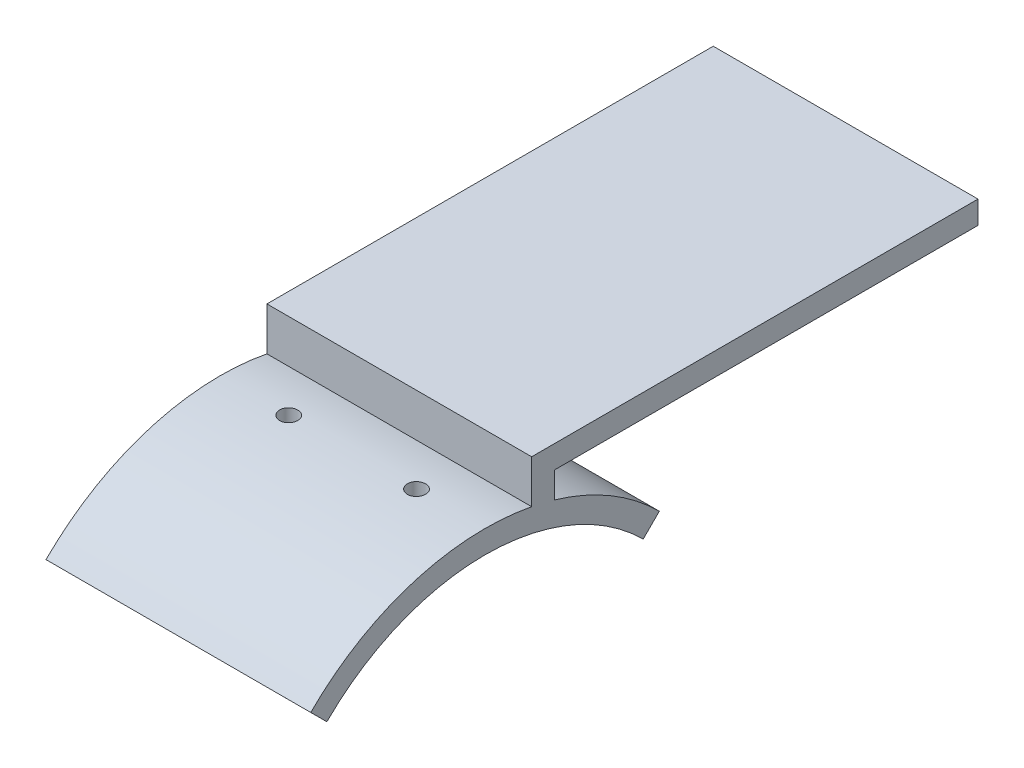
ISO-10303-21;
HEADER;
FILE_DESCRIPTION(('STEP AP214'),'2;1');
FILE_NAME('part.step','',(''),(''),'','','');
FILE_SCHEMA(('AUTOMOTIVE_DESIGN { 1 0 10303 214 1 1 1 1 }'));
ENDSEC;
DATA;
#1=APPLICATION_CONTEXT('core data for automotive mechanical design processes');
#2=APPLICATION_PROTOCOL_DEFINITION('international standard','automotive_design',2000,#1);
#3=PRODUCT_CONTEXT('',#1,'mechanical');
#4=PRODUCT('Part','Part','',(#3));
#5=PRODUCT_RELATED_PRODUCT_CATEGORY('part','',(#4));
#6=PRODUCT_DEFINITION_FORMATION('','',#4);
#7=PRODUCT_DEFINITION_CONTEXT('part definition',#1,'design');
#8=PRODUCT_DEFINITION('design','',#6,#7);
#9=PRODUCT_DEFINITION_SHAPE('','',#8);
#10=(LENGTH_UNIT() NAMED_UNIT(*) SI_UNIT(.MILLI.,.METRE.));
#11=(NAMED_UNIT(*) PLANE_ANGLE_UNIT() SI_UNIT($,.RADIAN.));
#12=(NAMED_UNIT(*) SI_UNIT($,.STERADIAN.) SOLID_ANGLE_UNIT());
#13=UNCERTAINTY_MEASURE_WITH_UNIT(LENGTH_MEASURE(1.E-05),#10,'distance_accuracy_value','');
#14=(GEOMETRIC_REPRESENTATION_CONTEXT(3) GLOBAL_UNCERTAINTY_ASSIGNED_CONTEXT((#13)) GLOBAL_UNIT_ASSIGNED_CONTEXT((#10,
#11,#12)) REPRESENTATION_CONTEXT('',''));
#15=CARTESIAN_POINT('',(0.,0.,0.));
#16=DIRECTION('',(0.,0.,1.));
#17=DIRECTION('',(1.,0.,0.));
#18=AXIS2_PLACEMENT_3D('',#15,#16,#17);
#19=CARTESIAN_POINT('',(58.,-49.,0.));
#20=DIRECTION('',(-1.,0.,0.));
#21=DIRECTION('',(0.,0.,1.));
#22=AXIS2_PLACEMENT_3D('',#19,#20,#21);
#23=CYLINDRICAL_SURFACE('',#22,54.);
#24=CARTESIAN_POINT('',(15.,4.96295025292816,-2.));
#25=CARTESIAN_POINT('',(14.8877004654641,4.96295075219625,-1.99999503270246));
#26=CARTESIAN_POINT('',(14.7753204837801,4.96330457041074,-1.99050985696399));
#27=CARTESIAN_POINT('',(14.5536583599373,4.96468192720475,-1.95280482207605));
#28=CARTESIAN_POINT('',(14.4443800648061,4.9657062625401,-1.92456267398281));
#29=CARTESIAN_POINT('',(14.2321645376487,4.96830846029025,-1.8501513309941));
#30=CARTESIAN_POINT('',(14.1292241942832,4.96988604852142,-1.80399101485833));
#31=CARTESIAN_POINT('',(13.9325819624977,4.97341664035689,-1.69506666197583));
#32=CARTESIAN_POINT('',(13.8388778483638,4.97536955318052,-1.63230663886105));
#33=CARTESIAN_POINT('',(13.6632813240093,4.97943214078296,-1.49191985783884));
#34=CARTESIAN_POINT('',(13.5813952386077,4.98154189859433,-1.41428519060976));
#35=CARTESIAN_POINT('',(13.4318127655717,4.98567963848786,-1.24636765667044));
#36=CARTESIAN_POINT('',(13.364116947148,4.98770761728701,-1.15608428282794));
#37=CARTESIAN_POINT('',(13.2448231574326,4.9914537389983,-0.965404059472298));
#38=CARTESIAN_POINT('',(13.1932295202032,4.99317179844014,-0.865004496689));
#39=CARTESIAN_POINT('',(13.1076326423792,4.99610369103976,-0.65696109417916));
#40=CARTESIAN_POINT('',(13.0736293128277,4.99731752674748,-0.549317291091011));
#41=CARTESIAN_POINT('',(13.024193360982,4.99910365419231,-0.329893785775234));
#42=CARTESIAN_POINT('',(13.0087521506924,4.99967624260208,-0.218116020869811));
#43=CARTESIAN_POINT('',(12.9968522783798,5.00011633116689,0.00644641286406914));
#44=CARTESIAN_POINT('',(13.0003935188961,4.99998383494201,0.11923107651989));
#45=CARTESIAN_POINT('',(13.0263508322198,4.99902894039687,0.342547605934101));
#46=CARTESIAN_POINT('',(13.0487576474903,4.99820688045356,0.453080549393811));
#47=CARTESIAN_POINT('',(13.1117957299707,4.99596588071386,0.668815003977497));
#48=CARTESIAN_POINT('',(13.1524270480244,4.99454693925226,0.77401650022657));
#49=CARTESIAN_POINT('',(13.2507713654548,4.99127148918127,0.976131592935503));
#50=CARTESIAN_POINT('',(13.3084886002621,4.98941487209969,1.07304312670836));
#51=CARTESIAN_POINT('',(13.4393632471326,4.98547326219279,1.25580474155332));
#52=CARTESIAN_POINT('',(13.5125207162394,4.98338826852377,1.34165478175718));
#53=CARTESIAN_POINT('',(13.6722515385268,4.97922334898793,1.49991041139662));
#54=CARTESIAN_POINT('',(13.7588329230215,4.977143426917,1.57230789500168));
#55=CARTESIAN_POINT('',(13.9429255568458,4.9732244006064,1.70154089734328));
#56=CARTESIAN_POINT('',(14.0404368082413,4.97138529641223,1.75837641313842));
#57=CARTESIAN_POINT('',(14.2436258474276,4.96815537784695,1.85487129914634));
#58=CARTESIAN_POINT('',(14.3493037660529,4.96676457065964,1.8945303941165));
#59=CARTESIAN_POINT('',(14.5658242206931,4.96458836861988,1.95554138636488));
#60=CARTESIAN_POINT('',(14.6766667353422,4.96380297126312,1.97689335937194));
#61=CARTESIAN_POINT('',(14.9002994172924,4.96292660777983,2.00067403394862));
#62=CARTESIAN_POINT('',(15.0130883882178,4.96283522931798,2.00311397168588));
#63=CARTESIAN_POINT('',(15.2374742888175,4.96335613160644,1.98903060797015));
#64=CARTESIAN_POINT('',(15.3490712206265,4.96396841109642,1.97250734048281));
#65=CARTESIAN_POINT('',(15.5678737983002,4.96582723482666,1.92097591146345));
#66=CARTESIAN_POINT('',(15.6750806509444,4.96707360348164,1.88597286705572));
#67=CARTESIAN_POINT('',(15.8820969497555,4.97005996090548,1.79848067721363));
#68=CARTESIAN_POINT('',(15.981906372771,4.97179995121912,1.74599147705664));
#69=CARTESIAN_POINT('',(16.1713463258866,4.97557841976828,1.62498802726334));
#70=CARTESIAN_POINT('',(16.2609720229563,4.97761703868614,1.55646621561187));
#71=CARTESIAN_POINT('',(16.4274518114463,4.98176246454917,1.40535371250946));
#72=CARTESIAN_POINT('',(16.5043058558399,4.98386927174539,1.32276296925734));
#73=CARTESIAN_POINT('',(16.6430983122484,4.98791478771046,1.1458088862065));
#74=CARTESIAN_POINT('',(16.705029475557,4.98985341449521,1.05143985881963));
#75=CARTESIAN_POINT('',(16.8121686240526,4.99334288231886,0.853636918662812));
#76=CARTESIAN_POINT('',(16.8573766573251,4.99489372447279,0.750203031958873));
#77=CARTESIAN_POINT('',(16.9297735445759,4.99743242260358,0.537233704007306));
#78=CARTESIAN_POINT('',(16.9569670768412,4.99842042473819,0.427699854909739));
#79=CARTESIAN_POINT('',(16.9925783710272,4.99972265765609,0.205617407781122));
#80=CARTESIAN_POINT('',(17.0009961757582,5.00003688997563,0.0930688166245369));
#81=CARTESIAN_POINT('',(16.9988165393224,4.99995617370588,-0.131776034819963));
#82=CARTESIAN_POINT('',(16.988230498112,4.99956165028225,-0.244072405950878));
#83=CARTESIAN_POINT('',(16.9483671608327,4.99810870018859,-0.465292712722726));
#84=CARTESIAN_POINT('',(16.9190898281955,4.99705027221968,-0.574216641765232));
#85=CARTESIAN_POINT('',(16.8426769294049,4.99438869003729,-0.785603515983294));
#86=CARTESIAN_POINT('',(16.7955411002166,4.99278552780054,-0.888066365968755));
#87=CARTESIAN_POINT('',(16.6847521100114,4.98921501319258,-1.08362305451929));
#88=CARTESIAN_POINT('',(16.621099519618,4.98724767340369,-1.17671721660103));
#89=CARTESIAN_POINT('',(16.4790463961729,4.98316913005195,-1.35094876301514));
#90=CARTESIAN_POINT('',(16.4006386112852,4.98105785607556,-1.432080232843));
#91=CARTESIAN_POINT('',(16.2312925741472,4.97692962875348,-1.58005160937692));
#92=CARTESIAN_POINT('',(16.140351229889,4.97491269884728,-1.64688797909108));
#93=CARTESIAN_POINT('',(15.9484734639744,4.97119973048303,-1.76438911512227));
#94=CARTESIAN_POINT('',(15.8475297027455,4.96950393035969,-1.81504188937958));
#95=CARTESIAN_POINT('',(15.6386416867103,4.96662859907737,-1.89862134948373));
#96=CARTESIAN_POINT('',(15.530705928725,4.96544845431244,-1.93156911426498));
#97=CARTESIAN_POINT('',(15.3517430096865,4.96405209880561,-1.97009805778151));
#98=CARTESIAN_POINT('',(15.2818767720653,4.96364070970133,-1.98129711610505));
#99=CARTESIAN_POINT('',(15.1413509819868,4.96308962968237,-1.99624964895));
#100=CARTESIAN_POINT('',(15.0706914298909,4.96294993864391,-2.00000312686394));
#101=CARTESIAN_POINT('',(15.,4.96295025292816,-2.));
#102=B_SPLINE_CURVE_WITH_KNOTS('',3,(#24,#25,#26,#27,#28,#29,#30,#31,#32,#33,#34,#35,#36,#37,
#38,#39,#40,#41,#42,#43,#44,#45,#46,#47,#48,#49,#50,#51,#52,#53,#54,#55,#56,#57,#58,#59,#60,#61,
#62,#63,#64,#65,#66,#67,#68,#69,#70,#71,#72,#73,#74,#75,#76,#77,#78,#79,#80,#81,#82,#83,#84,#85,
#86,#87,#88,#89,#90,#91,#92,#93,#94,#95,#96,#97,#98,#99,#100,#101),.UNSPECIFIED.,.T.,.F.,(4,2,2,
2,2,2,2,2,2,2,2,2,2,2,2,2,2,2,2,2,2,2,2,2,2,2,2,2,2,2,2,2,2,2,2,2,2,2,4),(0.,0.33664056542318,
0.673681878887206,1.0105563953544,1.34734953350205,1.68432225479064,2.02130849039912,
2.35838535113826,2.69546050720917,3.03237965116837,3.36929706530259,3.70604924679232,
4.04280236777934,4.37963903655089,4.71647694977707,5.053517170975,5.39055745587788,
5.72760314146463,6.06464743282898,6.40149146141841,6.73833488667564,7.07508508752152,
7.41183634223107,7.7487467519132,8.08565840211133,8.42273337684121,8.75980738234381,
9.09679381685139,9.43377948299982,9.77056306698981,10.1073473098796,10.4441365134018,
10.7809140830289,11.1178576053597,11.4548844003745,11.7921603564599,12.1290338694834,
12.3409458232649,12.5528576804904),.UNSPECIFIED.);
#103=CARTESIAN_POINT('',(15.,4.96295025292816,-2.));
#104=VERTEX_POINT('',#103);
#105=EDGE_CURVE('E152',#104,#104,#102,.T.);
#106=ORIENTED_EDGE('',*,*,#105,.F.);
#107=EDGE_LOOP('',(#106));
#108=FACE_BOUND('',#107,.T.);
#109=CARTESIAN_POINT('',(0.,-49.,0.));
#110=DIRECTION('',(1.,0.,0.));
#111=DIRECTION('',(0.,0.,1.));
#112=AXIS2_PLACEMENT_3D('',#109,#110,#111);
#113=CIRCLE('',#112,54.);
#114=CARTESIAN_POINT('',(0.,4.02446662482584,-10.2179224479701));
#115=VERTEX_POINT('',#114);
#116=CARTESIAN_POINT('',(0.,-10.8162338159265,38.1837661840736));
#117=VERTEX_POINT('',#116);
#118=EDGE_CURVE('E158',#115,#117,#113,.T.);
#119=ORIENTED_EDGE('',*,*,#118,.T.);
#120=DIRECTION('',(-1.,0.,0.));
#121=VECTOR('',#120,1.);
#122=CARTESIAN_POINT('',(58.,-10.8162338159265,38.1837661840736));
#123=LINE('',#122,#121);
#124=CARTESIAN_POINT('',(58.,-10.8162338159265,38.1837661840736));
#125=VERTEX_POINT('',#124);
#126=EDGE_CURVE('E174',#125,#117,#123,.T.);
#127=ORIENTED_EDGE('',*,*,#126,.F.);
#128=CARTESIAN_POINT('',(58.,-49.,0.));
#129=DIRECTION('',(1.,0.,0.));
#130=DIRECTION('',(0.,0.,1.));
#131=AXIS2_PLACEMENT_3D('',#128,#129,#130);
#132=CIRCLE('',#131,54.);
#133=CARTESIAN_POINT('',(58.,4.02446662482584,-10.2179224479701));
#134=VERTEX_POINT('',#133);
#135=EDGE_CURVE('E249',#134,#125,#132,.T.);
#136=ORIENTED_EDGE('',*,*,#135,.F.);
#137=DIRECTION('',(-1.,0.,0.));
#138=VECTOR('',#137,1.);
#139=CARTESIAN_POINT('',(58.,4.02446662482584,-10.2179224479701));
#140=LINE('',#139,#138);
#141=EDGE_CURVE('E177',#134,#115,#140,.T.);
#142=ORIENTED_EDGE('',*,*,#141,.T.);
#143=EDGE_LOOP('',(#119,#127,#136,#142));
#144=FACE_BOUND('',#143,.T.);
#145=CARTESIAN_POINT('',(43.,4.96295025292816,-2.));
#146=CARTESIAN_POINT('',(42.8877004654641,4.96295075219625,-1.99999503270246));
#147=CARTESIAN_POINT('',(42.7753204837801,4.96330457041074,-1.99050985696398));
#148=CARTESIAN_POINT('',(42.5536583599373,4.96468192720475,-1.95280482207605));
#149=CARTESIAN_POINT('',(42.4443800648061,4.9657062625401,-1.92456267398281));
#150=CARTESIAN_POINT('',(42.2321645376487,4.96830846029025,-1.8501513309941));
#151=CARTESIAN_POINT('',(42.1292241942832,4.96988604852143,-1.80399101485833));
#152=CARTESIAN_POINT('',(41.9325819624977,4.97341664035689,-1.69506666197583));
#153=CARTESIAN_POINT('',(41.8388778483638,4.97536955318052,-1.63230663886105));
#154=CARTESIAN_POINT('',(41.6632813240093,4.97943214078296,-1.49191985783884));
#155=CARTESIAN_POINT('',(41.5813952386077,4.98154189859433,-1.41428519060976));
#156=CARTESIAN_POINT('',(41.4318127655717,4.98567963848786,-1.24636765667044));
#157=CARTESIAN_POINT('',(41.364116947148,4.98770761728701,-1.15608428282794));
#158=CARTESIAN_POINT('',(41.2448231574326,4.9914537389983,-0.965404059472301));
#159=CARTESIAN_POINT('',(41.1932295202032,4.99317179844013,-0.865004496689002));
#160=CARTESIAN_POINT('',(41.1076326423792,4.99610369103976,-0.656961094179162));
#161=CARTESIAN_POINT('',(41.0736293128277,4.99731752674748,-0.549317291091013));
#162=CARTESIAN_POINT('',(41.024193360982,4.99910365419231,-0.329893785775239));
#163=CARTESIAN_POINT('',(41.0087521506924,4.99967624260207,-0.218116020869816));
#164=CARTESIAN_POINT('',(40.9968522783798,5.00011633116688,0.00644641286406233));
#165=CARTESIAN_POINT('',(41.0003935188961,4.999983834942,0.119231076519882));
#166=CARTESIAN_POINT('',(41.0263508322198,4.99902894039688,0.342547605934094));
#167=CARTESIAN_POINT('',(41.0487576474903,4.99820688045357,0.453080549393804));
#168=CARTESIAN_POINT('',(41.1117957299707,4.99596588071387,0.66881500397749));
#169=CARTESIAN_POINT('',(41.1524270480244,4.99454693925226,0.774016500226562));
#170=CARTESIAN_POINT('',(41.2507713654549,4.99127148918127,0.976131592935494));
#171=CARTESIAN_POINT('',(41.3084886002621,4.98941487209968,1.07304312670835));
#172=CARTESIAN_POINT('',(41.4393632471326,4.98547326219279,1.25580474155331));
#173=CARTESIAN_POINT('',(41.5125207162394,4.98338826852376,1.34165478175717));
#174=CARTESIAN_POINT('',(41.6722515385268,4.97922334898792,1.49991041139662));
#175=CARTESIAN_POINT('',(41.7588329230215,4.977143426917,1.57230789500167));
#176=CARTESIAN_POINT('',(41.9429255568458,4.9732244006064,1.70154089734327));
#177=CARTESIAN_POINT('',(42.0404368082413,4.97138529641223,1.75837641313841));
#178=CARTESIAN_POINT('',(42.2436258474276,4.96815537784695,1.85487129914633));
#179=CARTESIAN_POINT('',(42.3493037660529,4.96676457065964,1.89453039411649));
#180=CARTESIAN_POINT('',(42.565824220693,4.96458836861989,1.95554138636488));
#181=CARTESIAN_POINT('',(42.6766667353422,4.96380297126312,1.97689335937193));
#182=CARTESIAN_POINT('',(42.9002994172924,4.96292660777983,2.00067403394861));
#183=CARTESIAN_POINT('',(43.0130883882178,4.96283522931797,2.00311397168588));
#184=CARTESIAN_POINT('',(43.2374742888175,4.96335613160644,1.98903060797014));
#185=CARTESIAN_POINT('',(43.3490712206265,4.96396841109642,1.97250734048281));
#186=CARTESIAN_POINT('',(43.5678737983002,4.96582723482667,1.92097591146344));
#187=CARTESIAN_POINT('',(43.6750806509444,4.96707360348164,1.88597286705572));
#188=CARTESIAN_POINT('',(43.8820969497555,4.97005996090547,1.79848067721363));
#189=CARTESIAN_POINT('',(43.981906372771,4.97179995121911,1.74599147705664));
#190=CARTESIAN_POINT('',(44.1713463258866,4.97557841976827,1.62498802726334));
#191=CARTESIAN_POINT('',(44.2609720229563,4.97761703868613,1.55646621561188));
#192=CARTESIAN_POINT('',(44.4274518114463,4.98176246454917,1.40535371250947));
#193=CARTESIAN_POINT('',(44.5043058558399,4.98386927174539,1.32276296925734));
#194=CARTESIAN_POINT('',(44.6430983122484,4.98791478771047,1.14580888620651));
#195=CARTESIAN_POINT('',(44.705029475557,4.98985341449521,1.05143985881963));
#196=CARTESIAN_POINT('',(44.8121686240526,4.99334288231886,0.85363691866282));
#197=CARTESIAN_POINT('',(44.8573766573251,4.99489372447279,0.750203031958882));
#198=CARTESIAN_POINT('',(44.9297735445759,4.99743242260359,0.537233704007316));
#199=CARTESIAN_POINT('',(44.9569670768412,4.9984204247382,0.427699854909748));
#200=CARTESIAN_POINT('',(44.9925783710272,4.99972265765609,0.205617407781129));
#201=CARTESIAN_POINT('',(45.0009961757582,5.00003688997563,0.0930688166245441));
#202=CARTESIAN_POINT('',(44.9988165393224,4.99995617370588,-0.131776034819956));
#203=CARTESIAN_POINT('',(44.988230498112,4.99956165028224,-0.24407240595087));
#204=CARTESIAN_POINT('',(44.9483671608327,4.99810870018859,-0.465292712722717));
#205=CARTESIAN_POINT('',(44.9190898281955,4.99705027221968,-0.574216641765223));
#206=CARTESIAN_POINT('',(44.8426769294049,4.99438869003729,-0.785603515983283));
#207=CARTESIAN_POINT('',(44.7955411002166,4.99278552780054,-0.888066365968742));
#208=CARTESIAN_POINT('',(44.6847521100114,4.98921501319257,-1.08362305451928));
#209=CARTESIAN_POINT('',(44.621099519618,4.98724767340369,-1.17671721660102));
#210=CARTESIAN_POINT('',(44.4790463961729,4.98316913005195,-1.35094876301513));
#211=CARTESIAN_POINT('',(44.4006386112852,4.98105785607555,-1.43208023284299));
#212=CARTESIAN_POINT('',(44.2312925741472,4.97692962875347,-1.58005160937691));
#213=CARTESIAN_POINT('',(44.140351229889,4.97491269884728,-1.64688797909107));
#214=CARTESIAN_POINT('',(43.9484734639744,4.97119973048303,-1.76438911512226));
#215=CARTESIAN_POINT('',(43.8475297027455,4.96950393035968,-1.81504188937957));
#216=CARTESIAN_POINT('',(43.6386416867103,4.96662859907737,-1.89862134948372));
#217=CARTESIAN_POINT('',(43.530705928725,4.96544845431244,-1.93156911426497));
#218=CARTESIAN_POINT('',(43.3517430096865,4.9640520988056,-1.97009805778151));
#219=CARTESIAN_POINT('',(43.2818767720654,4.96364070970131,-1.98129711610505));
#220=CARTESIAN_POINT('',(43.1413509819868,4.96308962968236,-1.99624964895));
#221=CARTESIAN_POINT('',(43.0706914298909,4.9629499386439,-2.00000312686394));
#222=CARTESIAN_POINT('',(43.,4.96295025292816,-2.));
#223=B_SPLINE_CURVE_WITH_KNOTS('',3,(#145,#146,#147,#148,#149,#150,#151,#152,#153,#154,#155,
#156,#157,#158,#159,#160,#161,#162,#163,#164,#165,#166,#167,#168,#169,#170,#171,#172,#173,#174,
#175,#176,#177,#178,#179,#180,#181,#182,#183,#184,#185,#186,#187,#188,#189,#190,#191,#192,#193,
#194,#195,#196,#197,#198,#199,#200,#201,#202,#203,#204,#205,#206,#207,#208,#209,#210,#211,#212,
#213,#214,#215,#216,#217,#218,#219,#220,#221,#222),.UNSPECIFIED.,.T.,.F.,(4,2,2,2,2,2,2,2,2,2,2,
2,2,2,2,2,2,2,2,2,2,2,2,2,2,2,2,2,2,2,2,2,2,2,2,2,2,2,4),(0.,0.336640565423173,
0.673681878887201,1.0105563953544,1.34734953350204,1.68432225479063,2.02130849039911,
2.35838535113825,2.69546050720916,3.03237965116836,3.36929706530258,3.70604924679231,
4.04280236777934,4.37963903655088,4.71647694977705,5.05351717097499,5.39055745587786,
5.72760314146461,6.06464743282896,6.4014914614184,6.73833488667563,7.07508508752151,
7.41183634223105,7.74874675191318,8.08565840211131,8.42273337684119,8.75980738234379,
9.09679381685137,9.4337794829998,9.77056306698979,10.1073473098796,10.4441365134018,
10.7809140830289,11.1178576053597,11.4548844003744,11.7921603564599,12.1290338694834,
12.3409458232649,12.5528576804904),.UNSPECIFIED.);
#224=CARTESIAN_POINT('',(43.,4.96295025292816,-2.));
#225=VERTEX_POINT('',#224);
#226=EDGE_CURVE('E189',#225,#225,#223,.T.);
#227=ORIENTED_EDGE('',*,*,#226,.F.);
#228=EDGE_LOOP('',(#227));
#229=FACE_BOUND('',#228,.T.);
#230=ADVANCED_FACE('F33',(#108,#144,#229),#23,.T.);
#231=CARTESIAN_POINT('',(58.,-49.,0.));
#232=DIRECTION('',(-1.,0.,0.));
#233=DIRECTION('',(0.,0.,1.));
#234=AXIS2_PLACEMENT_3D('',#231,#232,#233);
#235=CYLINDRICAL_SURFACE('',#234,49.);
#236=CARTESIAN_POINT('',(15.,-0.040833340425428,-2.));
#237=CARTESIAN_POINT('',(15.1122906646094,-0.0408327906161083,-1.9999950359206));
#238=CARTESIAN_POINT('',(15.2246615595545,-0.0404428717965279,-1.99051135246692));
#239=CARTESIAN_POINT('',(15.4463051515274,-0.0389250001117448,-1.95281259092372));
#240=CARTESIAN_POINT('',(15.555574011188,-0.0377961714255084,-1.92457528380727));
#241=CARTESIAN_POINT('',(15.7677706189409,-0.0349285626458373,-1.85017755560255));
#242=CARTESIAN_POINT('',(15.8707015019317,-0.0331900869925265,-1.80402607910693));
#243=CARTESIAN_POINT('',(16.067326687263,-0.0292994623584544,-1.69512335148082));
#244=CARTESIAN_POINT('',(16.1610232012536,-0.0271474127955042,-1.63237608840124));
#245=CARTESIAN_POINT('',(16.33661601837,-0.0226703431124816,-1.49201158483202));
#246=CARTESIAN_POINT('',(16.4185049077715,-0.0203452156979879,-1.41438507264429));
#247=CARTESIAN_POINT('',(16.5680950254555,-0.0157850201273616,-1.24648336433033));
#248=CARTESIAN_POINT('',(16.6357956820169,-0.0135499556032838,-1.15620765874365));
#249=CARTESIAN_POINT('',(16.755105024095,-0.00942106520553834,-0.965535116091745));
#250=CARTESIAN_POINT('',(16.8067083803263,-0.00752735242959178,-0.865134941674747));
#251=CARTESIAN_POINT('',(16.8923239553899,-0.00429560450435746,-0.657087045857823));
#252=CARTESIAN_POINT('',(16.926336274693,-0.00295756618135896,-0.549439365855796));
#253=CARTESIAN_POINT('',(16.9757859298788,-0.000988647421016372,-0.330016320691211));
#254=CARTESIAN_POINT('',(16.991233701668,-0.000357369697729075,-0.218243311008522));
#255=CARTESIAN_POINT('',(17.0031479424907,0.000128209834215442,0.00631105577282886));
#256=CARTESIAN_POINT('',(16.9996145225269,-1.74838133761219E-05,0.119092406970829));
#257=CARTESIAN_POINT('',(16.973675393104,-0.00106908981602451,0.342391342158062));
#258=CARTESIAN_POINT('',(16.9512809266523,-0.00197454927600246,0.452910234599058));
#259=CARTESIAN_POINT('',(16.888272814767,-0.00444314588731798,0.668618662377646));
#260=CARTESIAN_POINT('',(16.8476591118022,-0.00600628511542064,0.773808180885419));
#261=CARTESIAN_POINT('',(16.7493525363261,-0.00961489456561298,0.975908140237197));
#262=CARTESIAN_POINT('',(16.6916545253938,-0.0116605098635757,1.072816078927));
#263=CARTESIAN_POINT('',(16.5608209440626,-0.0160036157382748,1.25557463583403));
#264=CARTESIAN_POINT('',(16.4876853030673,-0.01830110746682,1.34142520348296));
#265=CARTESIAN_POINT('',(16.3279889160805,-0.0228911143279413,1.49969758482241));
#266=CARTESIAN_POINT('',(16.2414184166772,-0.0251836246082355,1.57210955785414));
#267=CARTESIAN_POINT('',(16.0573440614687,-0.0295035271312415,1.70137346013587));
#268=CARTESIAN_POINT('',(15.9598402034057,-0.0315309193192052,1.75822538617265));
#269=CARTESIAN_POINT('',(15.7566611725788,-0.0350918440398133,1.85475441258694));
#270=CARTESIAN_POINT('',(15.6509858364103,-0.0366253666934164,1.89443116940914));
#271=CARTESIAN_POINT('',(15.4344661728015,-0.0390252298892861,1.95547713283643));
#272=CARTESIAN_POINT('',(15.3236218712995,-0.0398915737791355,1.97684643129963));
#273=CARTESIAN_POINT('',(15.0999964066249,-0.0408587741000641,2.00065876179984));
#274=CARTESIAN_POINT('',(14.9872166987658,-0.0409601824400542,2.0031154395147));
#275=CARTESIAN_POINT('',(14.7628465524151,-0.0403875167940645,1.98906837659272));
#276=CARTESIAN_POINT('',(14.6512561113243,-0.0397134445032513,1.97256467740243));
#277=CARTESIAN_POINT('',(14.4324703364959,-0.0376663024324779,1.92107664903447));
#278=CARTESIAN_POINT('',(14.325273535954,-0.0362934680202331,1.88609854253907));
#279=CARTESIAN_POINT('',(14.1182728524406,-0.0330037475042739,1.79866090075182));
#280=CARTESIAN_POINT('',(14.0184689977459,-0.0310868593197847,1.74620129860054));
#281=CARTESIAN_POINT('',(13.8290244487618,-0.026923756943913,1.62525469864026));
#282=CARTESIAN_POINT('',(13.7393896189383,-0.0246773544168939,1.55675852160804));
#283=CARTESIAN_POINT('',(13.5728864699673,-0.0201091047388794,1.4056965713397));
#284=CARTESIAN_POINT('',(13.496018206838,-0.0177872572568945,1.32313073637089));
#285=CARTESIAN_POINT('',(13.3571845009097,-0.013328227406426,1.14621468412768));
#286=CARTESIAN_POINT('',(13.2952278638236,-0.0111911546272481,1.05185755349459));
#287=CARTESIAN_POINT('',(13.1880363167019,-0.00734411439231732,0.854072449424184));
#288=CARTESIAN_POINT('',(13.1428013521155,-0.00563414554323738,0.750644505579765));
#289=CARTESIAN_POINT('',(13.0703526383443,-0.00283457391340783,0.537686702345185));
#290=CARTESIAN_POINT('',(13.0431332192471,-0.00174477596556192,0.4281587745389));
#291=CARTESIAN_POINT('',(13.0074696773722,-0.000307605317789096,0.206082914258823));
#292=CARTESIAN_POINT('',(12.9990254953312,3.97697255628856E-05,0.0935349913186482));
#293=CARTESIAN_POINT('',(13.0011527672505,-4.70455904616433E-05,-0.131298405496417));
#294=CARTESIAN_POINT('',(13.0117103839811,-0.000480667223303297,-0.243584010776922));
#295=CARTESIAN_POINT('',(13.0515130195538,-0.00207951942732932,-0.464787381590578));
#296=CARTESIAN_POINT('',(13.0807580746472,-0.00324475141774647,-0.573705140590098));
#297=CARTESIAN_POINT('',(13.1571028963837,-0.00617564996193087,-0.785084735260324));
#298=CARTESIAN_POINT('',(13.2042028981108,-0.00794132442128143,-0.887546485908473));
#299=CARTESIAN_POINT('',(13.3149175427475,-0.0118743396063771,-1.08310759199823));
#300=CARTESIAN_POINT('',(13.3785316317518,-0.0140416668594306,-1.17620726131181));
#301=CARTESIAN_POINT('',(13.5205157720374,-0.0185356508041156,-1.35046901429345));
#302=CARTESIAN_POINT('',(13.5988949562171,-0.0208624055392478,-1.43162365376332));
#303=CARTESIAN_POINT('',(13.7681880074796,-0.0254125395672348,-1.57964649016502));
#304=CARTESIAN_POINT('',(13.8591049639606,-0.0276358932001838,-1.64651115555746));
#305=CARTESIAN_POINT('',(14.0509454395016,-0.0317295911916402,-1.76407687304271));
#306=CARTESIAN_POINT('',(14.1518768696203,-0.0335996530215983,-1.81476501085555));
#307=CARTESIAN_POINT('',(14.3607481791424,-0.0367711009779536,-1.8984163481447));
#308=CARTESIAN_POINT('',(14.4686795673817,-0.0380731618169815,-1.93140058838495));
#309=CARTESIAN_POINT('',(14.6477395326729,-0.0396153019342602,-1.97000935819228));
#310=CARTESIAN_POINT('',(14.7177069985512,-0.0400700676158981,-1.98124159875397));
#311=CARTESIAN_POINT('',(14.8584390127694,-0.0406792600981702,-1.99623848243822));
#312=CARTESIAN_POINT('',(14.9292035606645,-0.0408336870663734,-2.00000312972719));
#313=CARTESIAN_POINT('',(15.,-0.040833340425428,-2.));
#314=B_SPLINE_CURVE_WITH_KNOTS('',3,(#236,#237,#238,#239,#240,#241,#242,#243,#244,#245,#246,
#247,#248,#249,#250,#251,#252,#253,#254,#255,#256,#257,#258,#259,#260,#261,#262,#263,#264,#265,
#266,#267,#268,#269,#270,#271,#272,#273,#274,#275,#276,#277,#278,#279,#280,#281,#282,#283,#284,
#285,#286,#287,#288,#289,#290,#291,#292,#293,#294,#295,#296,#297,#298,#299,#300,#301,#302,#303,
#304,#305,#306,#307,#308,#309,#310,#311,#312,#313),.UNSPECIFIED.,.T.,.F.,(4,2,2,2,2,2,2,2,2,2,2,
2,2,2,2,2,2,2,2,2,2,2,2,2,2,2,2,2,2,2,2,2,2,2,2,2,2,2,4),(0.,0.336613569060328,
0.673626846389871,1.01047206809466,1.3472364176291,1.68421130118215,2.02119976068002,
2.35829966783387,2.69539764962962,3.03230604581904,3.3692124717605,3.70591821092061,
4.04262501330936,4.37943318953192,4.71624290601308,5.05329829277052,5.3903537491315,
5.72741594730933,6.06447645425982,6.40129374528533,6.73811030004445,7.07481347811924,
7.41151794395813,7.74841561030751,8.08531475488288,8.42241236191928,8.7595088692389,
9.0964992339122,9.43348853488874,9.77023253741358,10.1069771931818,10.4437262827903,
10.7804640788243,11.1174108508625,11.4544407978799,11.7917391383383,12.1286357131228,
12.3408622192224,12.5530886069136),.UNSPECIFIED.);
#315=CARTESIAN_POINT('',(15.,-0.040833340425428,-2.));
#316=VERTEX_POINT('',#315);
#317=EDGE_CURVE('E184',#316,#316,#314,.T.);
#318=ORIENTED_EDGE('',*,*,#317,.F.);
#319=EDGE_LOOP('',(#318));
#320=FACE_BOUND('',#319,.T.);
#321=CARTESIAN_POINT('',(0.,-49.,0.));
#322=DIRECTION('',(-1.,0.,0.));
#323=DIRECTION('',(0.,0.,1.));
#324=AXIS2_PLACEMENT_3D('',#321,#322,#323);
#325=CIRCLE('',#324,49.);
#326=CARTESIAN_POINT('',(0.,-14.3517677218592,34.6482322781409));
#327=VERTEX_POINT('',#326);
#328=CARTESIAN_POINT('',(0.,-14.3517677218592,-34.6482322781409));
#329=VERTEX_POINT('',#328);
#330=EDGE_CURVE('E162',#327,#329,#325,.T.);
#331=ORIENTED_EDGE('',*,*,#330,.T.);
#332=DIRECTION('',(-1.,0.,0.));
#333=VECTOR('',#332,1.);
#334=CARTESIAN_POINT('',(58.,-14.3517677218592,-34.6482322781409));
#335=LINE('',#334,#333);
#336=CARTESIAN_POINT('',(58.,-14.3517677218592,-34.6482322781409));
#337=VERTEX_POINT('',#336);
#338=EDGE_CURVE('E139',#337,#329,#335,.T.);
#339=ORIENTED_EDGE('',*,*,#338,.F.);
#340=CARTESIAN_POINT('',(58.,-49.,0.));
#341=DIRECTION('',(-1.,0.,0.));
#342=DIRECTION('',(0.,0.,1.));
#343=AXIS2_PLACEMENT_3D('',#340,#341,#342);
#344=CIRCLE('',#343,49.);
#345=CARTESIAN_POINT('',(58.,-14.3517677218592,34.6482322781409));
#346=VERTEX_POINT('',#345);
#347=EDGE_CURVE('E130',#346,#337,#344,.T.);
#348=ORIENTED_EDGE('',*,*,#347,.F.);
#349=DIRECTION('',(-1.,0.,0.));
#350=VECTOR('',#349,1.);
#351=CARTESIAN_POINT('',(58.,-14.3517677218592,34.6482322781409));
#352=LINE('',#351,#350);
#353=EDGE_CURVE('E171',#346,#327,#352,.T.);
#354=ORIENTED_EDGE('',*,*,#353,.T.);
#355=EDGE_LOOP('',(#331,#339,#348,#354));
#356=FACE_BOUND('',#355,.T.);
#357=CARTESIAN_POINT('',(43.,-0.040833340425428,-2.));
#358=CARTESIAN_POINT('',(43.1122906646094,-0.0408327906161083,-1.9999950359206));
#359=CARTESIAN_POINT('',(43.2246615595545,-0.0404428717965279,-1.99051135246692));
#360=CARTESIAN_POINT('',(43.4463051515274,-0.0389250001117449,-1.95281259092372));
#361=CARTESIAN_POINT('',(43.555574011188,-0.0377961714255086,-1.92457528380727));
#362=CARTESIAN_POINT('',(43.7677706189409,-0.0349285626458375,-1.85017755560254));
#363=CARTESIAN_POINT('',(43.8707015019317,-0.0331900869925267,-1.80402607910692));
#364=CARTESIAN_POINT('',(44.067326687263,-0.0292994623584547,-1.69512335148082));
#365=CARTESIAN_POINT('',(44.1610232012536,-0.0271474127955046,-1.63237608840124));
#366=CARTESIAN_POINT('',(44.33661601837,-0.0226703431124821,-1.49201158483202));
#367=CARTESIAN_POINT('',(44.4185049077714,-0.0203452156979884,-1.41438507264429));
#368=CARTESIAN_POINT('',(44.5680950254555,-0.0157850201273622,-1.24648336433033));
#369=CARTESIAN_POINT('',(44.6357956820169,-0.0135499556032844,-1.15620765874365));
#370=CARTESIAN_POINT('',(44.755105024095,-0.00942106520553891,-0.965535116091748));
#371=CARTESIAN_POINT('',(44.8067083803263,-0.00752735242959233,-0.865134941674748));
#372=CARTESIAN_POINT('',(44.8923239553899,-0.00429560450435801,-0.657087045857824));
#373=CARTESIAN_POINT('',(44.926336274693,-0.00295756618135953,-0.549439365855797));
#374=CARTESIAN_POINT('',(44.9757859298788,-0.000988647421016965,-0.330016320691214));
#375=CARTESIAN_POINT('',(44.991233701668,-0.000357369697729673,-0.218243311008524));
#376=CARTESIAN_POINT('',(45.0031479424907,0.000128209834214843,0.00631105577282568));
#377=CARTESIAN_POINT('',(44.9996145225269,-1.74838133767181E-05,0.119092406970825));
#378=CARTESIAN_POINT('',(44.973675393104,-0.00106908981602509,0.342391342158059));
#379=CARTESIAN_POINT('',(44.9512809266523,-0.00197454927600302,0.452910234599055));
#380=CARTESIAN_POINT('',(44.888272814767,-0.00444314588731851,0.668618662377641));
#381=CARTESIAN_POINT('',(44.8476591118022,-0.00600628511542115,0.773808180885414));
#382=CARTESIAN_POINT('',(44.7493525363261,-0.00961489456561346,0.975908140237192));
#383=CARTESIAN_POINT('',(44.6916545253938,-0.0116605098635762,1.07281607892699));
#384=CARTESIAN_POINT('',(44.5608209440626,-0.0160036157382752,1.25557463583402));
#385=CARTESIAN_POINT('',(44.4876853030673,-0.0183011074668204,1.34142520348295));
#386=CARTESIAN_POINT('',(44.3279889160805,-0.0228911143279416,1.49969758482241));
#387=CARTESIAN_POINT('',(44.2414184166772,-0.0251836246082357,1.57210955785413));
#388=CARTESIAN_POINT('',(44.0573440614686,-0.0295035271312417,1.70137346013586));
#389=CARTESIAN_POINT('',(43.9598402034057,-0.0315309193192055,1.75822538617264));
#390=CARTESIAN_POINT('',(43.7566611725788,-0.0350918440398134,1.85475441258694));
#391=CARTESIAN_POINT('',(43.6509858364103,-0.0366253666934165,1.89443116940914));
#392=CARTESIAN_POINT('',(43.4344661728015,-0.0390252298892862,1.95547713283643));
#393=CARTESIAN_POINT('',(43.3236218712995,-0.0398915737791356,1.97684643129963));
#394=CARTESIAN_POINT('',(43.0999964066249,-0.0408587741000642,2.00065876179984));
#395=CARTESIAN_POINT('',(42.9872166987658,-0.0409601824400543,2.00311543951469));
#396=CARTESIAN_POINT('',(42.7628465524151,-0.0403875167940646,1.98906837659271));
#397=CARTESIAN_POINT('',(42.6512561113243,-0.0397134445032513,1.97256467740242));
#398=CARTESIAN_POINT('',(42.4324703364959,-0.037666302432478,1.92107664903447));
#399=CARTESIAN_POINT('',(42.325273535954,-0.0362934680202332,1.88609854253907));
#400=CARTESIAN_POINT('',(42.1182728524406,-0.0330037475042739,1.79866090075182));
#401=CARTESIAN_POINT('',(42.0184689977459,-0.0310868593197846,1.74620129860054));
#402=CARTESIAN_POINT('',(41.8290244487618,-0.0269237569439129,1.62525469864025));
#403=CARTESIAN_POINT('',(41.7393896189383,-0.0246773544168938,1.55675852160804));
#404=CARTESIAN_POINT('',(41.5728864699673,-0.0201091047388793,1.4056965713397));
#405=CARTESIAN_POINT('',(41.496018206838,-0.0177872572568944,1.32313073637089));
#406=CARTESIAN_POINT('',(41.3571845009097,-0.0133282274064259,1.14621468412768));
#407=CARTESIAN_POINT('',(41.2952278638236,-0.0111911546272481,1.0518575534946));
#408=CARTESIAN_POINT('',(41.1880363167019,-0.00734411439231738,0.854072449424191));
#409=CARTESIAN_POINT('',(41.1428013521155,-0.00563414554323743,0.750644505579771));
#410=CARTESIAN_POINT('',(41.0703526383443,-0.00283457391340783,0.537686702345192));
#411=CARTESIAN_POINT('',(41.0431332192471,-0.0017447759655619,0.428158774538907));
#412=CARTESIAN_POINT('',(41.0074696773722,-0.000307605317789025,0.20608291425883));
#413=CARTESIAN_POINT('',(40.9990254953312,3.97697255629847E-05,0.0935349913186541));
#414=CARTESIAN_POINT('',(41.0011527672505,-4.70455904615136E-05,-0.131298405496412));
#415=CARTESIAN_POINT('',(41.0117103839811,-0.000480667223303158,-0.243584010776916));
#416=CARTESIAN_POINT('',(41.0515130195538,-0.00207951942732916,-0.464787381590572));
#417=CARTESIAN_POINT('',(41.0807580746472,-0.0032447514177463,-0.573705140590092));
#418=CARTESIAN_POINT('',(41.1571028963837,-0.00617564996193073,-0.785084735260321));
#419=CARTESIAN_POINT('',(41.2042028981108,-0.00794132442128135,-0.887546485908473));
#420=CARTESIAN_POINT('',(41.3149175427475,-0.0118743396063771,-1.08310759199823));
#421=CARTESIAN_POINT('',(41.3785316317517,-0.0140416668594305,-1.17620726131181));
#422=CARTESIAN_POINT('',(41.5205157720374,-0.0185356508041156,-1.35046901429344));
#423=CARTESIAN_POINT('',(41.5988949562171,-0.0208624055392479,-1.43162365376332));
#424=CARTESIAN_POINT('',(41.7681880074796,-0.0254125395672348,-1.57964649016502));
#425=CARTESIAN_POINT('',(41.8591049639606,-0.0276358932001837,-1.64651115555745));
#426=CARTESIAN_POINT('',(42.0509454395016,-0.03172959119164,-1.76407687304271));
#427=CARTESIAN_POINT('',(42.1518768696203,-0.0335996530215982,-1.81476501085554));
#428=CARTESIAN_POINT('',(42.3607481791423,-0.0367711009779536,-1.8984163481447));
#429=CARTESIAN_POINT('',(42.4686795673817,-0.0380731618169815,-1.93140058838495));
#430=CARTESIAN_POINT('',(42.6477395326729,-0.0396153019342602,-1.97000935819228));
#431=CARTESIAN_POINT('',(42.7177069985512,-0.0400700676158981,-1.98124159875397));
#432=CARTESIAN_POINT('',(42.8584390127694,-0.0406792600981703,-1.99623848243821));
#433=CARTESIAN_POINT('',(42.9292035606645,-0.0408336870663734,-2.00000312972718));
#434=CARTESIAN_POINT('',(43.,-0.040833340425428,-2.));
#435=B_SPLINE_CURVE_WITH_KNOTS('',3,(#357,#358,#359,#360,#361,#362,#363,#364,#365,#366,#367,
#368,#369,#370,#371,#372,#373,#374,#375,#376,#377,#378,#379,#380,#381,#382,#383,#384,#385,#386,
#387,#388,#389,#390,#391,#392,#393,#394,#395,#396,#397,#398,#399,#400,#401,#402,#403,#404,#405,
#406,#407,#408,#409,#410,#411,#412,#413,#414,#415,#416,#417,#418,#419,#420,#421,#422,#423,#424,
#425,#426,#427,#428,#429,#430,#431,#432,#433,#434),.UNSPECIFIED.,.T.,.F.,(4,2,2,2,2,2,2,2,2,2,2,
2,2,2,2,2,2,2,2,2,2,2,2,2,2,2,2,2,2,2,2,2,2,2,2,2,2,2,4),(0.,0.336613569060325,
0.673626846389867,1.01047206809467,1.34723641762909,1.68421130118215,2.02119976068001,
2.35829966783386,2.69539764962961,3.03230604581903,3.3692124717605,3.7059182109206,
4.04262501330935,4.3794331895319,4.71624290601307,5.05329829277051,5.3903537491315,
5.72741594730932,6.06447645425981,6.40129374528531,6.73811030004443,7.07481347811922,
7.41151794395812,7.74841561030749,8.08531475488287,8.42241236191926,8.75950886923888,
9.09649923391218,9.43348853488872,9.77023253741356,10.1069771931818,10.4437262827902,
10.7804640788243,11.1174108508625,11.4544407978799,11.7917391383383,12.1286357131228,
12.3408622192224,12.5530886069136),.UNSPECIFIED.);
#436=CARTESIAN_POINT('',(43.,-0.040833340425428,-2.));
#437=VERTEX_POINT('',#436);
#438=EDGE_CURVE('E37',#437,#437,#435,.T.);
#439=ORIENTED_EDGE('',*,*,#438,.F.);
#440=EDGE_LOOP('',(#439));
#441=FACE_BOUND('',#440,.T.);
#442=ADVANCED_FACE('F190',(#320,#356,#441),#235,.F.);
#443=CARTESIAN_POINT('',(58.,8.5,-15.2179224479701));
#444=DIRECTION('',(0.,1.,0.));
#445=DIRECTION('',(0.,0.,1.));
#446=AXIS2_PLACEMENT_3D('',#443,#444,#445);
#447=PLANE('',#446);
#448=DIRECTION('',(0.,0.,-1.));
#449=VECTOR('',#448,1.);
#450=CARTESIAN_POINT('',(0.,8.5,-15.2179224479701));
#451=LINE('',#450,#449);
#452=CARTESIAN_POINT('',(0.,8.5,-15.2179224479701));
#453=VERTEX_POINT('',#452);
#454=CARTESIAN_POINT('',(0.,8.5,-108.));
#455=VERTEX_POINT('',#454);
#456=EDGE_CURVE('E148',#453,#455,#451,.T.);
#457=ORIENTED_EDGE('',*,*,#456,.T.);
#458=DIRECTION('',(-1.,0.,0.));
#459=VECTOR('',#458,1.);
#460=CARTESIAN_POINT('',(58.,8.5,-108.));
#461=LINE('',#460,#459);
#462=CARTESIAN_POINT('',(58.,8.5,-108.));
#463=VERTEX_POINT('',#462);
#464=EDGE_CURVE('E11',#463,#455,#461,.T.);
#465=ORIENTED_EDGE('',*,*,#464,.F.);
#466=DIRECTION('',(0.,0.,-1.));
#467=VECTOR('',#466,1.);
#468=CARTESIAN_POINT('',(58.,8.5,-15.2179224479701));
#469=LINE('',#468,#467);
#470=CARTESIAN_POINT('',(58.,8.5,-15.2179224479701));
#471=VERTEX_POINT('',#470);
#472=EDGE_CURVE('E167',#471,#463,#469,.T.);
#473=ORIENTED_EDGE('',*,*,#472,.F.);
#474=DIRECTION('',(-1.,0.,0.));
#475=VECTOR('',#474,1.);
#476=CARTESIAN_POINT('',(58.,8.5,-15.2179224479701));
#477=LINE('',#476,#475);
#478=EDGE_CURVE('E144',#471,#453,#477,.T.);
#479=ORIENTED_EDGE('',*,*,#478,.T.);
#480=EDGE_LOOP('',(#457,#465,#473,#479));
#481=FACE_BOUND('',#480,.T.);
#482=ADVANCED_FACE('F35',(#481),#447,.F.);
#483=CARTESIAN_POINT('',(58.,8.5,-108.));
#484=DIRECTION('',(0.,0.,1.));
#485=DIRECTION('',(1.,0.,0.));
#486=AXIS2_PLACEMENT_3D('',#483,#484,#485);
#487=PLANE('',#486);
#488=DIRECTION('',(0.,1.,0.));
#489=VECTOR('',#488,1.);
#490=CARTESIAN_POINT('',(0.,8.5,-108.));
#491=LINE('',#490,#489);
#492=CARTESIAN_POINT('',(0.,13.5,-108.));
#493=VERTEX_POINT('',#492);
#494=EDGE_CURVE('E151',#455,#493,#491,.T.);
#495=ORIENTED_EDGE('',*,*,#494,.T.);
#496=DIRECTION('',(-1.,0.,0.));
#497=VECTOR('',#496,1.);
#498=CARTESIAN_POINT('',(58.,13.5,-108.));
#499=LINE('',#498,#497);
#500=CARTESIAN_POINT('',(58.,13.5,-108.));
#501=VERTEX_POINT('',#500);
#502=EDGE_CURVE('E47',#501,#493,#499,.T.);
#503=ORIENTED_EDGE('',*,*,#502,.F.);
#504=DIRECTION('',(0.,1.,0.));
#505=VECTOR('',#504,1.);
#506=CARTESIAN_POINT('',(58.,8.5,-108.));
#507=LINE('',#506,#505);
#508=EDGE_CURVE('E105',#463,#501,#507,.T.);
#509=ORIENTED_EDGE('',*,*,#508,.F.);
#510=ORIENTED_EDGE('',*,*,#464,.T.);
#511=EDGE_LOOP('',(#495,#503,#509,#510));
#512=FACE_BOUND('',#511,.T.);
#513=ADVANCED_FACE('F226',(#512),#487,.F.);
#514=CARTESIAN_POINT('',(58.,13.5,-10.2179224479701));
#515=DIRECTION('',(0.,-1.,0.));
#516=DIRECTION('',(0.,0.,-1.));
#517=AXIS2_PLACEMENT_3D('',#514,#515,#516);
#518=PLANE('',#517);
#519=DIRECTION('',(0.,0.,1.));
#520=VECTOR('',#519,1.);
#521=CARTESIAN_POINT('',(0.,13.5,-10.2179224479701));
#522=LINE('',#521,#520);
#523=CARTESIAN_POINT('',(0.,13.5,-10.2179224479701));
#524=VERTEX_POINT('',#523);
#525=EDGE_CURVE('E154',#493,#524,#522,.T.);
#526=ORIENTED_EDGE('',*,*,#525,.T.);
#527=DIRECTION('',(-1.,0.,0.));
#528=VECTOR('',#527,1.);
#529=CARTESIAN_POINT('',(58.,13.5,-10.2179224479701));
#530=LINE('',#529,#528);
#531=CARTESIAN_POINT('',(58.,13.5,-10.2179224479701));
#532=VERTEX_POINT('',#531);
#533=EDGE_CURVE('E180',#532,#524,#530,.T.);
#534=ORIENTED_EDGE('',*,*,#533,.F.);
#535=DIRECTION('',(0.,0.,1.));
#536=VECTOR('',#535,1.);
#537=CARTESIAN_POINT('',(58.,13.5,-10.2179224479701));
#538=LINE('',#537,#536);
#539=EDGE_CURVE('E239',#501,#532,#538,.T.);
#540=ORIENTED_EDGE('',*,*,#539,.F.);
#541=ORIENTED_EDGE('',*,*,#502,.T.);
#542=EDGE_LOOP('',(#526,#534,#540,#541));
#543=FACE_BOUND('',#542,.T.);
#544=ADVANCED_FACE('F223',(#543),#518,.F.);
#545=CARTESIAN_POINT('',(58.,13.5,-10.2179224479701));
#546=DIRECTION('',(0.,0.,-1.));
#547=DIRECTION('',(-1.,0.,0.));
#548=AXIS2_PLACEMENT_3D('',#545,#546,#547);
#549=PLANE('',#548);
#550=DIRECTION('',(0.,-1.,0.));
#551=VECTOR('',#550,1.);
#552=CARTESIAN_POINT('',(0.,13.5,-10.2179224479701));
#553=LINE('',#552,#551);
#554=EDGE_CURVE('E156',#524,#115,#553,.T.);
#555=ORIENTED_EDGE('',*,*,#554,.T.);
#556=ORIENTED_EDGE('',*,*,#141,.F.);
#557=DIRECTION('',(0.,-1.,0.));
#558=VECTOR('',#557,1.);
#559=CARTESIAN_POINT('',(58.,13.5,-10.2179224479701));
#560=LINE('',#559,#558);
#561=EDGE_CURVE('E252',#532,#134,#560,.T.);
#562=ORIENTED_EDGE('',*,*,#561,.F.);
#563=ORIENTED_EDGE('',*,*,#533,.T.);
#564=EDGE_LOOP('',(#555,#556,#562,#563));
#565=FACE_BOUND('',#564,.T.);
#566=ADVANCED_FACE('F219',(#565),#549,.F.);
#567=CARTESIAN_POINT('',(58.,-14.3517677218592,34.6482322781409));
#568=DIRECTION('',(0.,0.70710678118655,-0.707106781186546));
#569=DIRECTION('',(0.,0.707106781186546,0.70710678118655));
#570=AXIS2_PLACEMENT_3D('',#567,#568,#569);
#571=PLANE('',#570);
#572=DIRECTION('',(0.,-0.707106781186545,-0.70710678118655));
#573=VECTOR('',#572,1.);
#574=CARTESIAN_POINT('',(0.,-14.3517677218592,34.6482322781409));
#575=LINE('',#574,#573);
#576=EDGE_CURVE('E160',#117,#327,#575,.T.);
#577=ORIENTED_EDGE('',*,*,#576,.T.);
#578=ORIENTED_EDGE('',*,*,#353,.F.);
#579=DIRECTION('',(0.,-0.707106781186545,-0.70710678118655));
#580=VECTOR('',#579,1.);
#581=CARTESIAN_POINT('',(58.,-14.3517677218592,34.6482322781409));
#582=LINE('',#581,#580);
#583=EDGE_CURVE('E251',#125,#346,#582,.T.);
#584=ORIENTED_EDGE('',*,*,#583,.F.);
#585=ORIENTED_EDGE('',*,*,#126,.T.);
#586=EDGE_LOOP('',(#577,#578,#584,#585));
#587=FACE_BOUND('',#586,.T.);
#588=ADVANCED_FACE('F218',(#587),#571,.F.);
#589=CARTESIAN_POINT('',(58.,-14.3517677218592,-34.6482322781409));
#590=DIRECTION('',(0.,0.707106781186548,0.707106781186547));
#591=DIRECTION('',(0.,-0.707106781186547,0.707106781186548));
#592=AXIS2_PLACEMENT_3D('',#589,#590,#591);
#593=PLANE('',#592);
#594=DIRECTION('',(0.,0.707106781186547,-0.707106781186548));
#595=VECTOR('',#594,1.);
#596=CARTESIAN_POINT('',(0.,-14.3517677218592,-34.6482322781409));
#597=LINE('',#596,#595);
#598=CARTESIAN_POINT('',(0.,-10.8162338159265,-38.1837661840736));
#599=VERTEX_POINT('',#598);
#600=EDGE_CURVE('E138',#329,#599,#597,.T.);
#601=ORIENTED_EDGE('',*,*,#600,.T.);
#602=DIRECTION('',(-1.,0.,0.));
#603=VECTOR('',#602,1.);
#604=CARTESIAN_POINT('',(58.,-10.8162338159265,-38.1837661840736));
#605=LINE('',#604,#603);
#606=CARTESIAN_POINT('',(58.,-10.8162338159265,-38.1837661840736));
#607=VERTEX_POINT('',#606);
#608=EDGE_CURVE('E135',#607,#599,#605,.T.);
#609=ORIENTED_EDGE('',*,*,#608,.F.);
#610=DIRECTION('',(0.,0.707106781186547,-0.707106781186548));
#611=VECTOR('',#610,1.);
#612=CARTESIAN_POINT('',(58.,-14.3517677218592,-34.6482322781409));
#613=LINE('',#612,#611);
#614=EDGE_CURVE('E124',#337,#607,#613,.T.);
#615=ORIENTED_EDGE('',*,*,#614,.F.);
#616=ORIENTED_EDGE('',*,*,#338,.T.);
#617=EDGE_LOOP('',(#601,#609,#615,#616));
#618=FACE_BOUND('',#617,.T.);
#619=ADVANCED_FACE('F136',(#618),#593,.F.);
#620=CARTESIAN_POINT('',(58.,-49.,0.));
#621=DIRECTION('',(-1.,0.,0.));
#622=DIRECTION('',(0.,0.,1.));
#623=AXIS2_PLACEMENT_3D('',#620,#621,#622);
#624=CYLINDRICAL_SURFACE('',#623,54.);
#625=CARTESIAN_POINT('',(0.,-49.,0.));
#626=DIRECTION('',(1.,0.,0.));
#627=DIRECTION('',(0.,0.,1.));
#628=AXIS2_PLACEMENT_3D('',#625,#626,#627);
#629=CIRCLE('',#628,54.);
#630=CARTESIAN_POINT('',(0.,2.81133887835333,-15.2179224479701));
#631=VERTEX_POINT('',#630);
#632=EDGE_CURVE('E91',#599,#631,#629,.T.);
#633=ORIENTED_EDGE('',*,*,#632,.T.);
#634=DIRECTION('',(-1.,0.,0.));
#635=VECTOR('',#634,1.);
#636=CARTESIAN_POINT('',(58.,2.81133887835333,-15.2179224479701));
#637=LINE('',#636,#635);
#638=CARTESIAN_POINT('',(58.,2.81133887835333,-15.2179224479701));
#639=VERTEX_POINT('',#638);
#640=EDGE_CURVE('E140',#639,#631,#637,.T.);
#641=ORIENTED_EDGE('',*,*,#640,.F.);
#642=CARTESIAN_POINT('',(58.,-49.,0.));
#643=DIRECTION('',(1.,0.,0.));
#644=DIRECTION('',(0.,0.,1.));
#645=AXIS2_PLACEMENT_3D('',#642,#643,#644);
#646=CIRCLE('',#645,54.);
#647=EDGE_CURVE('E128',#607,#639,#646,.T.);
#648=ORIENTED_EDGE('',*,*,#647,.F.);
#649=ORIENTED_EDGE('',*,*,#608,.T.);
#650=EDGE_LOOP('',(#633,#641,#648,#649));
#651=FACE_BOUND('',#650,.T.);
#652=ADVANCED_FACE('F142',(#651),#624,.T.);
#653=CARTESIAN_POINT('',(58.,8.5,-15.2179224479701));
#654=DIRECTION('',(0.,0.,1.));
#655=DIRECTION('',(1.,0.,0.));
#656=AXIS2_PLACEMENT_3D('',#653,#654,#655);
#657=PLANE('',#656);
#658=DIRECTION('',(0.,1.,0.));
#659=VECTOR('',#658,1.);
#660=CARTESIAN_POINT('',(0.,8.5,-15.2179224479701));
#661=LINE('',#660,#659);
#662=EDGE_CURVE('E97',#631,#453,#661,.T.);
#663=ORIENTED_EDGE('',*,*,#662,.T.);
#664=ORIENTED_EDGE('',*,*,#478,.F.);
#665=DIRECTION('',(0.,1.,0.));
#666=VECTOR('',#665,1.);
#667=CARTESIAN_POINT('',(58.,8.5,-15.2179224479701));
#668=LINE('',#667,#666);
#669=EDGE_CURVE('E56',#639,#471,#668,.T.);
#670=ORIENTED_EDGE('',*,*,#669,.F.);
#671=ORIENTED_EDGE('',*,*,#640,.T.);
#672=EDGE_LOOP('',(#663,#664,#670,#671));
#673=FACE_BOUND('',#672,.T.);
#674=ADVANCED_FACE('F270',(#673),#657,.F.);
#675=CARTESIAN_POINT('',(58.,-49.,0.));
#676=DIRECTION('',(-1.,0.,0.));
#677=DIRECTION('',(0.,0.,1.));
#678=AXIS2_PLACEMENT_3D('',#675,#676,#677);
#679=PLANE('',#678);
#680=ORIENTED_EDGE('',*,*,#472,.T.);
#681=ORIENTED_EDGE('',*,*,#508,.T.);
#682=ORIENTED_EDGE('',*,*,#539,.T.);
#683=ORIENTED_EDGE('',*,*,#561,.T.);
#684=ORIENTED_EDGE('',*,*,#135,.T.);
#685=ORIENTED_EDGE('',*,*,#583,.T.);
#686=ORIENTED_EDGE('',*,*,#347,.T.);
#687=ORIENTED_EDGE('',*,*,#614,.T.);
#688=ORIENTED_EDGE('',*,*,#647,.T.);
#689=ORIENTED_EDGE('',*,*,#669,.T.);
#690=EDGE_LOOP('',(#680,#681,#682,#683,#684,#685,#686,#687,#688,#689));
#691=FACE_BOUND('',#690,.T.);
#692=ADVANCED_FACE('F126',(#691),#679,.F.);
#693=CARTESIAN_POINT('',(0.,-49.,0.));
#694=DIRECTION('',(-1.,0.,0.));
#695=DIRECTION('',(0.,0.,1.));
#696=AXIS2_PLACEMENT_3D('',#693,#694,#695);
#697=PLANE('',#696);
#698=ORIENTED_EDGE('',*,*,#456,.F.);
#699=ORIENTED_EDGE('',*,*,#662,.F.);
#700=ORIENTED_EDGE('',*,*,#632,.F.);
#701=ORIENTED_EDGE('',*,*,#600,.F.);
#702=ORIENTED_EDGE('',*,*,#330,.F.);
#703=ORIENTED_EDGE('',*,*,#576,.F.);
#704=ORIENTED_EDGE('',*,*,#118,.F.);
#705=ORIENTED_EDGE('',*,*,#554,.F.);
#706=ORIENTED_EDGE('',*,*,#525,.F.);
#707=ORIENTED_EDGE('',*,*,#494,.F.);
#708=EDGE_LOOP('',(#698,#699,#700,#701,#702,#703,#704,#705,#706,#707));
#709=FACE_BOUND('',#708,.T.);
#710=ADVANCED_FACE('F199',(#709),#697,.T.);
#711=CARTESIAN_POINT('',(15.,58.,0.));
#712=DIRECTION('',(0.,-1.,0.));
#713=DIRECTION('',(0.,0.,-1.));
#714=AXIS2_PLACEMENT_3D('',#711,#712,#713);
#715=CYLINDRICAL_SURFACE('',#714,2.);
#716=ORIENTED_EDGE('',*,*,#317,.T.);
#717=EDGE_LOOP('',(#716));
#718=FACE_BOUND('',#717,.T.);
#719=ORIENTED_EDGE('',*,*,#105,.T.);
#720=EDGE_LOOP('',(#719));
#721=FACE_BOUND('',#720,.T.);
#722=ADVANCED_FACE('F194',(#718,#721),#715,.F.);
#723=CARTESIAN_POINT('',(43.,58.,0.));
#724=DIRECTION('',(0.,-1.,0.));
#725=DIRECTION('',(0.,0.,-1.));
#726=AXIS2_PLACEMENT_3D('',#723,#724,#725);
#727=CYLINDRICAL_SURFACE('',#726,2.);
#728=ORIENTED_EDGE('',*,*,#438,.T.);
#729=EDGE_LOOP('',(#728));
#730=FACE_BOUND('',#729,.T.);
#731=ORIENTED_EDGE('',*,*,#226,.T.);
#732=EDGE_LOOP('',(#731));
#733=FACE_BOUND('',#732,.T.);
#734=ADVANCED_FACE('F198',(#730,#733),#727,.F.);
#735=CLOSED_SHELL('',(#230,#442,#482,#513,#544,#566,#588,#619,#652,#674,#692,#710,#722,#734));
#736=MANIFOLD_SOLID_BREP('B2',#735);
#737=ADVANCED_BREP_SHAPE_REPRESENTATION('',(#18,#736),#14);
#738=SHAPE_DEFINITION_REPRESENTATION(#9,#737);
ENDSEC;
END-ISO-10303-21;
